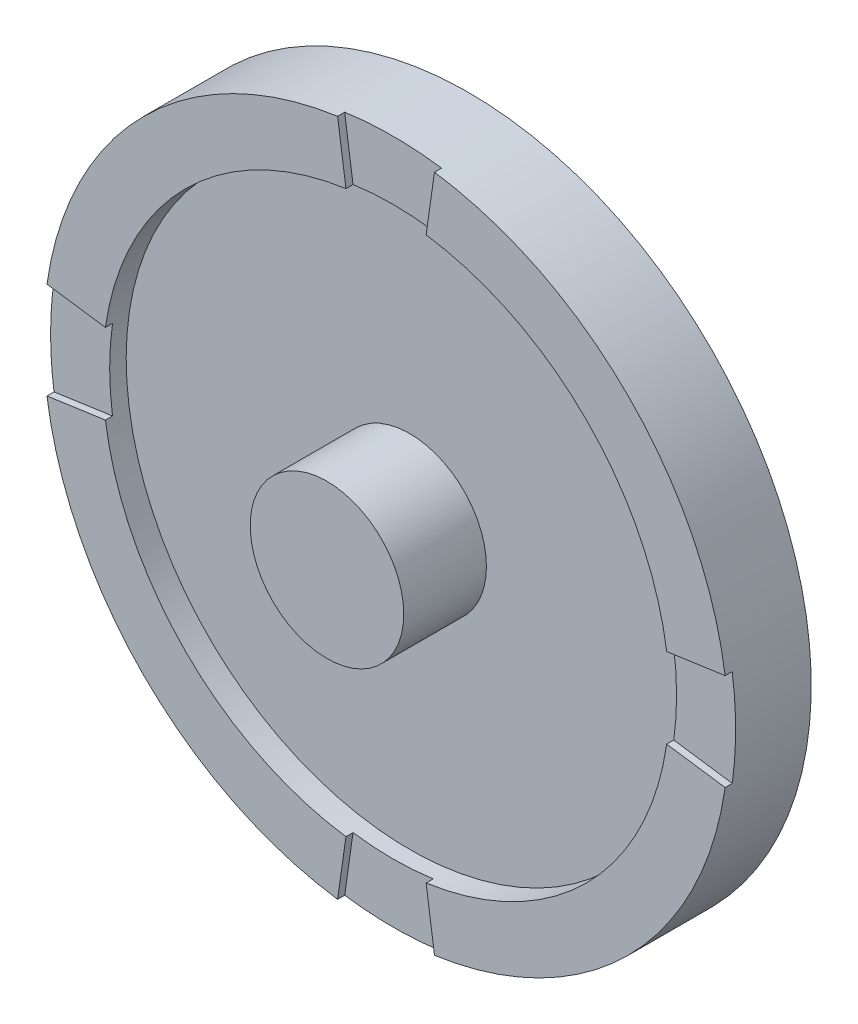
ISO-10303-21;
HEADER;
FILE_DESCRIPTION(('STEP AP214'),'2;1');
FILE_NAME('part.step','',(''),(''),'','','');
FILE_SCHEMA(('AUTOMOTIVE_DESIGN { 1 0 10303 214 1 1 1 1 }'));
ENDSEC;
DATA;
#1=APPLICATION_CONTEXT('core data for automotive mechanical design processes');
#2=APPLICATION_PROTOCOL_DEFINITION('international standard','automotive_design',2000,#1);
#3=PRODUCT_CONTEXT('',#1,'mechanical');
#4=PRODUCT('Part','Part','',(#3));
#5=PRODUCT_RELATED_PRODUCT_CATEGORY('part','',(#4));
#6=PRODUCT_DEFINITION_FORMATION('','',#4);
#7=PRODUCT_DEFINITION_CONTEXT('part definition',#1,'design');
#8=PRODUCT_DEFINITION('design','',#6,#7);
#9=PRODUCT_DEFINITION_SHAPE('','',#8);
#10=(LENGTH_UNIT() NAMED_UNIT(*) SI_UNIT(.MILLI.,.METRE.));
#11=(NAMED_UNIT(*) PLANE_ANGLE_UNIT() SI_UNIT($,.RADIAN.));
#12=(NAMED_UNIT(*) SI_UNIT($,.STERADIAN.) SOLID_ANGLE_UNIT());
#13=UNCERTAINTY_MEASURE_WITH_UNIT(LENGTH_MEASURE(1.E-05),#10,'distance_accuracy_value','');
#14=(GEOMETRIC_REPRESENTATION_CONTEXT(3) GLOBAL_UNCERTAINTY_ASSIGNED_CONTEXT((#13)) GLOBAL_UNIT_ASSIGNED_CONTEXT((#10,
#11,#12)) REPRESENTATION_CONTEXT('',''));
#15=CARTESIAN_POINT('',(0.,0.,0.));
#16=DIRECTION('',(0.,0.,1.));
#17=DIRECTION('',(1.,0.,0.));
#18=AXIS2_PLACEMENT_3D('',#15,#16,#17);
#19=CARTESIAN_POINT('',(0.,0.,7.));
#20=DIRECTION('',(0.,0.,-1.));
#21=DIRECTION('',(-1.,0.,0.));
#22=AXIS2_PLACEMENT_3D('',#19,#20,#21);
#23=PLANE('',#22);
#24=CARTESIAN_POINT('',(0.,0.,7.));
#25=DIRECTION('',(0.,0.,-1.));
#26=DIRECTION('',(-1.,0.,0.));
#27=AXIS2_PLACEMENT_3D('',#24,#25,#26);
#28=CIRCLE('',#27,24.);
#29=CARTESIAN_POINT('',(23.758787847868,-3.39411254969543,7.));
#30=VERTEX_POINT('',#29);
#31=CARTESIAN_POINT('',(3.39411254969543,-23.758787847868,7.));
#32=VERTEX_POINT('',#31);
#33=EDGE_CURVE('E247',#30,#32,#28,.T.);
#34=ORIENTED_EDGE('',*,*,#33,.T.);
#35=DIRECTION('',(-0.14142135623731,0.989949493661166,0.));
#36=VECTOR('',#35,1.);
#37=CARTESIAN_POINT('',(3.39411254969543,-23.758787847868,7.));
#38=LINE('',#37,#36);
#39=CARTESIAN_POINT('',(4.10121933088197,-28.7085353161738,7.));
#40=VERTEX_POINT('',#39);
#41=EDGE_CURVE('E159',#40,#32,#38,.T.);
#42=ORIENTED_EDGE('',*,*,#41,.F.);
#43=CARTESIAN_POINT('',(0.,0.,7.));
#44=DIRECTION('',(0.,0.,-1.));
#45=DIRECTION('',(-1.,0.,0.));
#46=AXIS2_PLACEMENT_3D('',#43,#44,#45);
#47=CIRCLE('',#46,29.);
#48=CARTESIAN_POINT('',(28.7085353161738,-4.10121933088198,7.));
#49=VERTEX_POINT('',#48);
#50=EDGE_CURVE('E251',#49,#40,#47,.T.);
#51=ORIENTED_EDGE('',*,*,#50,.F.);
#52=DIRECTION('',(0.989949493661167,-0.14142135623731,0.));
#53=VECTOR('',#52,1.);
#54=CARTESIAN_POINT('',(23.758787847868,-3.39411254969543,7.));
#55=LINE('',#54,#53);
#56=EDGE_CURVE('E213',#30,#49,#55,.T.);
#57=ORIENTED_EDGE('',*,*,#56,.F.);
#58=EDGE_LOOP('',(#34,#42,#51,#57));
#59=FACE_BOUND('',#58,.T.);
#60=ADVANCED_FACE('F31',(#59),#23,.F.);
#61=CARTESIAN_POINT('',(-4.10121933088197,-28.7085353161738,7.));
#62=VERTEX_POINT('',#61);
#63=CARTESIAN_POINT('',(-28.7085353161738,-4.10121933088196,7.));
#64=VERTEX_POINT('',#63);
#65=EDGE_CURVE('E255',#62,#64,#47,.T.);
#66=ORIENTED_EDGE('',*,*,#65,.F.);
#67=DIRECTION('',(-0.141421356237309,-0.989949493661166,0.));
#68=VECTOR('',#67,1.);
#69=CARTESIAN_POINT('',(-3.39411254969543,-23.758787847868,7.));
#70=LINE('',#69,#68);
#71=CARTESIAN_POINT('',(-3.39411254969543,-23.758787847868,7.));
#72=VERTEX_POINT('',#71);
#73=EDGE_CURVE('E314',#72,#62,#70,.T.);
#74=ORIENTED_EDGE('',*,*,#73,.F.);
#75=CARTESIAN_POINT('',(-23.758787847868,-3.39411254969543,7.));
#76=VERTEX_POINT('',#75);
#77=EDGE_CURVE('E164',#72,#76,#28,.T.);
#78=ORIENTED_EDGE('',*,*,#77,.T.);
#79=DIRECTION('',(0.989949493661167,0.14142135623731,0.));
#80=VECTOR('',#79,1.);
#81=CARTESIAN_POINT('',(-23.758787847868,-3.39411254969543,7.));
#82=LINE('',#81,#80);
#83=EDGE_CURVE('E174',#64,#76,#82,.T.);
#84=ORIENTED_EDGE('',*,*,#83,.F.);
#85=EDGE_LOOP('',(#66,#74,#78,#84));
#86=FACE_BOUND('',#85,.T.);
#87=ADVANCED_FACE('F277',(#86),#23,.F.);
#88=CARTESIAN_POINT('',(-28.7085353161738,4.10121933088197,7.));
#89=VERTEX_POINT('',#88);
#90=CARTESIAN_POINT('',(-4.10121933088198,28.7085353161738,7.));
#91=VERTEX_POINT('',#90);
#92=EDGE_CURVE('E303',#89,#91,#47,.T.);
#93=ORIENTED_EDGE('',*,*,#92,.F.);
#94=DIRECTION('',(-0.989949493661166,0.14142135623731,0.));
#95=VECTOR('',#94,1.);
#96=CARTESIAN_POINT('',(-23.758787847868,3.39411254969543,7.));
#97=LINE('',#96,#95);
#98=CARTESIAN_POINT('',(-23.758787847868,3.39411254969543,7.));
#99=VERTEX_POINT('',#98);
#100=EDGE_CURVE('E181',#99,#89,#97,.T.);
#101=ORIENTED_EDGE('',*,*,#100,.F.);
#102=CARTESIAN_POINT('',(-3.39411254969543,23.758787847868,7.));
#103=VERTEX_POINT('',#102);
#104=EDGE_CURVE('E315',#99,#103,#28,.T.);
#105=ORIENTED_EDGE('',*,*,#104,.T.);
#106=DIRECTION('',(0.141421356237309,-0.989949493661166,0.));
#107=VECTOR('',#106,1.);
#108=CARTESIAN_POINT('',(-3.39411254969543,23.758787847868,7.));
#109=LINE('',#108,#107);
#110=EDGE_CURVE('E199',#91,#103,#109,.T.);
#111=ORIENTED_EDGE('',*,*,#110,.F.);
#112=EDGE_LOOP('',(#93,#101,#105,#111));
#113=FACE_BOUND('',#112,.T.);
#114=ADVANCED_FACE('F269',(#113),#23,.F.);
#115=CARTESIAN_POINT('',(0.,0.,5.));
#116=DIRECTION('',(0.,0.,1.));
#117=DIRECTION('',(1.,0.,0.));
#118=AXIS2_PLACEMENT_3D('',#115,#116,#117);
#119=PLANE('',#118);
#120=CARTESIAN_POINT('',(0.,0.,5.));
#121=DIRECTION('',(0.,0.,1.));
#122=DIRECTION('',(1.,0.,0.));
#123=AXIS2_PLACEMENT_3D('',#120,#121,#122);
#124=CIRCLE('',#123,24.);
#125=CARTESIAN_POINT('',(24.,0.,5.));
#126=VERTEX_POINT('',#125);
#127=EDGE_CURVE('E254',#126,#126,#124,.T.);
#128=ORIENTED_EDGE('',*,*,#127,.T.);
#129=EDGE_LOOP('',(#128));
#130=FACE_BOUND('',#129,.T.);
#131=CARTESIAN_POINT('',(0.,0.,5.));
#132=DIRECTION('',(0.,0.,1.));
#133=DIRECTION('',(1.,0.,0.));
#134=AXIS2_PLACEMENT_3D('',#131,#132,#133);
#135=CIRCLE('',#134,6.5);
#136=CARTESIAN_POINT('',(6.5,0.,5.));
#137=VERTEX_POINT('',#136);
#138=EDGE_CURVE('E35',#137,#137,#135,.T.);
#139=ORIENTED_EDGE('',*,*,#138,.F.);
#140=EDGE_LOOP('',(#139));
#141=FACE_BOUND('',#140,.T.);
#142=ADVANCED_FACE('F267',(#130,#141),#119,.T.);
#143=CARTESIAN_POINT('',(0.,0.,12.));
#144=DIRECTION('',(0.,0.,-1.));
#145=DIRECTION('',(-1.,0.,0.));
#146=AXIS2_PLACEMENT_3D('',#143,#144,#145);
#147=CYLINDRICAL_SURFACE('',#146,6.5);
#148=CARTESIAN_POINT('',(0.,0.,12.));
#149=DIRECTION('',(0.,0.,1.));
#150=DIRECTION('',(1.,0.,0.));
#151=AXIS2_PLACEMENT_3D('',#148,#149,#150);
#152=CIRCLE('',#151,6.5);
#153=CARTESIAN_POINT('',(6.5,0.,12.));
#154=VERTEX_POINT('',#153);
#155=EDGE_CURVE('E11',#154,#154,#152,.T.);
#156=ORIENTED_EDGE('',*,*,#155,.F.);
#157=EDGE_LOOP('',(#156));
#158=FACE_BOUND('',#157,.T.);
#159=ORIENTED_EDGE('',*,*,#138,.T.);
#160=EDGE_LOOP('',(#159));
#161=FACE_BOUND('',#160,.T.);
#162=ADVANCED_FACE('F265',(#158,#161),#147,.T.);
#163=CARTESIAN_POINT('',(0.,0.,12.));
#164=DIRECTION('',(0.,0.,1.));
#165=DIRECTION('',(1.,0.,0.));
#166=AXIS2_PLACEMENT_3D('',#163,#164,#165);
#167=PLANE('',#166);
#168=ORIENTED_EDGE('',*,*,#155,.T.);
#169=EDGE_LOOP('',(#168));
#170=FACE_BOUND('',#169,.T.);
#171=ADVANCED_FACE('F274',(#170),#167,.T.);
#172=CARTESIAN_POINT('',(0.,0.,7.));
#173=DIRECTION('',(0.,0.,-1.));
#174=DIRECTION('',(-1.,0.,0.));
#175=AXIS2_PLACEMENT_3D('',#172,#173,#174);
#176=CYLINDRICAL_SURFACE('',#175,29.);
#177=DIRECTION('',(0.,0.,1.));
#178=VECTOR('',#177,1.);
#179=CARTESIAN_POINT('',(4.10121933088197,-28.7085353161738,6.4));
#180=LINE('',#179,#178);
#181=CARTESIAN_POINT('',(4.10121933088197,-28.7085353161738,6.4));
#182=VERTEX_POINT('',#181);
#183=EDGE_CURVE('E166',#182,#40,#180,.T.);
#184=ORIENTED_EDGE('',*,*,#183,.F.);
#185=CARTESIAN_POINT('',(0.,0.,6.4));
#186=DIRECTION('',(0.,0.,1.));
#187=DIRECTION('',(-1.,0.,0.));
#188=AXIS2_PLACEMENT_3D('',#185,#186,#187);
#189=CIRCLE('',#188,29.);
#190=CARTESIAN_POINT('',(-4.10121933088197,-28.7085353161738,6.4));
#191=VERTEX_POINT('',#190);
#192=EDGE_CURVE('E152',#191,#182,#189,.T.);
#193=ORIENTED_EDGE('',*,*,#192,.F.);
#194=DIRECTION('',(0.,0.,1.));
#195=VECTOR('',#194,1.);
#196=CARTESIAN_POINT('',(-4.10121933088197,-28.7085353161738,6.4));
#197=LINE('',#196,#195);
#198=EDGE_CURVE('E150',#191,#62,#197,.T.);
#199=ORIENTED_EDGE('',*,*,#198,.T.);
#200=ORIENTED_EDGE('',*,*,#65,.T.);
#201=DIRECTION('',(0.,0.,1.));
#202=VECTOR('',#201,1.);
#203=CARTESIAN_POINT('',(-28.7085353161738,-4.10121933088196,6.4));
#204=LINE('',#203,#202);
#205=CARTESIAN_POINT('',(-28.7085353161738,-4.10121933088196,6.4));
#206=VERTEX_POINT('',#205);
#207=EDGE_CURVE('E189',#206,#64,#204,.T.);
#208=ORIENTED_EDGE('',*,*,#207,.F.);
#209=CARTESIAN_POINT('',(0.,0.,6.4));
#210=DIRECTION('',(0.,0.,1.));
#211=DIRECTION('',(-1.,0.,0.));
#212=AXIS2_PLACEMENT_3D('',#209,#210,#211);
#213=CIRCLE('',#212,29.);
#214=CARTESIAN_POINT('',(-28.7085353161738,4.10121933088197,6.4));
#215=VERTEX_POINT('',#214);
#216=EDGE_CURVE('E177',#215,#206,#213,.T.);
#217=ORIENTED_EDGE('',*,*,#216,.F.);
#218=DIRECTION('',(0.,0.,1.));
#219=VECTOR('',#218,1.);
#220=CARTESIAN_POINT('',(-28.7085353161738,4.10121933088197,6.4));
#221=LINE('',#220,#219);
#222=EDGE_CURVE('E192',#215,#89,#221,.T.);
#223=ORIENTED_EDGE('',*,*,#222,.T.);
#224=ORIENTED_EDGE('',*,*,#92,.T.);
#225=DIRECTION('',(0.,0.,1.));
#226=VECTOR('',#225,1.);
#227=CARTESIAN_POINT('',(-4.10121933088198,28.7085353161738,6.4));
#228=LINE('',#227,#226);
#229=CARTESIAN_POINT('',(-4.10121933088198,28.7085353161738,6.4));
#230=VERTEX_POINT('',#229);
#231=EDGE_CURVE('E214',#230,#91,#228,.T.);
#232=ORIENTED_EDGE('',*,*,#231,.F.);
#233=CARTESIAN_POINT('',(0.,0.,6.4));
#234=DIRECTION('',(0.,0.,1.));
#235=DIRECTION('',(-1.,0.,0.));
#236=AXIS2_PLACEMENT_3D('',#233,#234,#235);
#237=CIRCLE('',#236,29.);
#238=CARTESIAN_POINT('',(4.10121933088197,28.7085353161738,6.4));
#239=VERTEX_POINT('',#238);
#240=EDGE_CURVE('E202',#239,#230,#237,.T.);
#241=ORIENTED_EDGE('',*,*,#240,.F.);
#242=DIRECTION('',(0.,0.,1.));
#243=VECTOR('',#242,1.);
#244=CARTESIAN_POINT('',(4.10121933088197,28.7085353161738,6.4));
#245=LINE('',#244,#243);
#246=CARTESIAN_POINT('',(4.10121933088197,28.7085353161738,7.));
#247=VERTEX_POINT('',#246);
#248=EDGE_CURVE('E217',#239,#247,#245,.T.);
#249=ORIENTED_EDGE('',*,*,#248,.T.);
#250=CARTESIAN_POINT('',(28.7085353161738,4.10121933088198,7.));
#251=VERTEX_POINT('',#250);
#252=EDGE_CURVE('E256',#247,#251,#47,.T.);
#253=ORIENTED_EDGE('',*,*,#252,.T.);
#254=DIRECTION('',(0.,0.,1.));
#255=VECTOR('',#254,1.);
#256=CARTESIAN_POINT('',(28.7085353161738,4.10121933088198,6.4));
#257=LINE('',#256,#255);
#258=CARTESIAN_POINT('',(28.7085353161738,4.10121933088198,6.4));
#259=VERTEX_POINT('',#258);
#260=EDGE_CURVE('E240',#259,#251,#257,.T.);
#261=ORIENTED_EDGE('',*,*,#260,.F.);
#262=CARTESIAN_POINT('',(0.,0.,6.4));
#263=DIRECTION('',(0.,0.,1.));
#264=DIRECTION('',(-1.,0.,0.));
#265=AXIS2_PLACEMENT_3D('',#262,#263,#264);
#266=CIRCLE('',#265,29.);
#267=CARTESIAN_POINT('',(28.7085353161738,-4.10121933088198,6.4));
#268=VERTEX_POINT('',#267);
#269=EDGE_CURVE('E228',#268,#259,#266,.T.);
#270=ORIENTED_EDGE('',*,*,#269,.F.);
#271=DIRECTION('',(0.,0.,1.));
#272=VECTOR('',#271,1.);
#273=CARTESIAN_POINT('',(28.7085353161738,-4.10121933088198,6.4));
#274=LINE('',#273,#272);
#275=EDGE_CURVE('E243',#268,#49,#274,.T.);
#276=ORIENTED_EDGE('',*,*,#275,.T.);
#277=ORIENTED_EDGE('',*,*,#50,.T.);
#278=EDGE_LOOP('',(#184,#193,#199,#200,#208,#217,#223,#224,#232,#241,#249,#253,#261,#270,#276,#277));
#279=FACE_BOUND('',#278,.T.);
#280=CARTESIAN_POINT('',(0.,0.,0.));
#281=DIRECTION('',(0.,0.,-1.));
#282=DIRECTION('',(-1.,0.,0.));
#283=AXIS2_PLACEMENT_3D('',#280,#281,#282);
#284=CIRCLE('',#283,29.);
#285=CARTESIAN_POINT('',(-29.,0.,0.));
#286=VERTEX_POINT('',#285);
#287=EDGE_CURVE('E250',#286,#286,#284,.T.);
#288=ORIENTED_EDGE('',*,*,#287,.F.);
#289=EDGE_LOOP('',(#288));
#290=FACE_BOUND('',#289,.T.);
#291=ADVANCED_FACE('F290',(#279,#290),#176,.T.);
#292=ORIENTED_EDGE('',*,*,#252,.F.);
#293=DIRECTION('',(0.141421356237309,0.989949493661167,0.));
#294=VECTOR('',#293,1.);
#295=CARTESIAN_POINT('',(3.39411254969543,23.758787847868,7.));
#296=LINE('',#295,#294);
#297=CARTESIAN_POINT('',(3.39411254969543,23.758787847868,7.));
#298=VERTEX_POINT('',#297);
#299=EDGE_CURVE('E188',#298,#247,#296,.T.);
#300=ORIENTED_EDGE('',*,*,#299,.F.);
#301=CARTESIAN_POINT('',(23.758787847868,3.39411254969543,7.));
#302=VERTEX_POINT('',#301);
#303=EDGE_CURVE('E239',#298,#302,#28,.T.);
#304=ORIENTED_EDGE('',*,*,#303,.T.);
#305=DIRECTION('',(-0.989949493661167,-0.141421356237309,0.));
#306=VECTOR('',#305,1.);
#307=CARTESIAN_POINT('',(23.758787847868,3.39411254969543,7.));
#308=LINE('',#307,#306);
#309=EDGE_CURVE('E225',#251,#302,#308,.T.);
#310=ORIENTED_EDGE('',*,*,#309,.F.);
#311=EDGE_LOOP('',(#292,#300,#304,#310));
#312=FACE_BOUND('',#311,.T.);
#313=ADVANCED_FACE('F280',(#312),#23,.F.);
#314=CARTESIAN_POINT('',(0.,0.,7.));
#315=DIRECTION('',(0.,0.,-1.));
#316=DIRECTION('',(-1.,0.,0.));
#317=AXIS2_PLACEMENT_3D('',#314,#315,#316);
#318=CYLINDRICAL_SURFACE('',#317,24.);
#319=ORIENTED_EDGE('',*,*,#127,.F.);
#320=EDGE_LOOP('',(#319));
#321=FACE_BOUND('',#320,.T.);
#322=CARTESIAN_POINT('',(0.,0.,6.4));
#323=DIRECTION('',(0.,0.,-1.));
#324=DIRECTION('',(-1.,0.,0.));
#325=AXIS2_PLACEMENT_3D('',#322,#323,#324);
#326=CIRCLE('',#325,24.);
#327=CARTESIAN_POINT('',(3.39411254969543,-23.758787847868,6.4));
#328=VERTEX_POINT('',#327);
#329=CARTESIAN_POINT('',(-3.39411254969543,-23.758787847868,6.4));
#330=VERTEX_POINT('',#329);
#331=EDGE_CURVE('E153',#328,#330,#326,.T.);
#332=ORIENTED_EDGE('',*,*,#331,.F.);
#333=DIRECTION('',(0.,0.,1.));
#334=VECTOR('',#333,1.);
#335=CARTESIAN_POINT('',(3.39411254969543,-23.758787847868,6.4));
#336=LINE('',#335,#334);
#337=EDGE_CURVE('E183',#328,#32,#336,.T.);
#338=ORIENTED_EDGE('',*,*,#337,.T.);
#339=ORIENTED_EDGE('',*,*,#33,.F.);
#340=DIRECTION('',(0.,0.,1.));
#341=VECTOR('',#340,1.);
#342=CARTESIAN_POINT('',(23.758787847868,-3.39411254969543,6.4));
#343=LINE('',#342,#341);
#344=CARTESIAN_POINT('',(23.758787847868,-3.39411254969543,6.4));
#345=VERTEX_POINT('',#344);
#346=EDGE_CURVE('E232',#345,#30,#343,.T.);
#347=ORIENTED_EDGE('',*,*,#346,.F.);
#348=CARTESIAN_POINT('',(0.,0.,6.4));
#349=DIRECTION('',(0.,0.,-1.));
#350=DIRECTION('',(-1.,0.,0.));
#351=AXIS2_PLACEMENT_3D('',#348,#349,#350);
#352=CIRCLE('',#351,24.);
#353=CARTESIAN_POINT('',(23.758787847868,3.39411254969543,6.4));
#354=VERTEX_POINT('',#353);
#355=EDGE_CURVE('E221',#354,#345,#352,.T.);
#356=ORIENTED_EDGE('',*,*,#355,.F.);
#357=DIRECTION('',(0.,0.,1.));
#358=VECTOR('',#357,1.);
#359=CARTESIAN_POINT('',(23.758787847868,3.39411254969543,6.4));
#360=LINE('',#359,#358);
#361=EDGE_CURVE('E236',#354,#302,#360,.T.);
#362=ORIENTED_EDGE('',*,*,#361,.T.);
#363=ORIENTED_EDGE('',*,*,#303,.F.);
#364=DIRECTION('',(0.,0.,1.));
#365=VECTOR('',#364,1.);
#366=CARTESIAN_POINT('',(3.39411254969543,23.758787847868,6.4));
#367=LINE('',#366,#365);
#368=CARTESIAN_POINT('',(3.39411254969543,23.758787847868,6.4));
#369=VERTEX_POINT('',#368);
#370=EDGE_CURVE('E206',#369,#298,#367,.T.);
#371=ORIENTED_EDGE('',*,*,#370,.F.);
#372=CARTESIAN_POINT('',(0.,0.,6.4));
#373=DIRECTION('',(0.,0.,-1.));
#374=DIRECTION('',(1.,0.,0.));
#375=AXIS2_PLACEMENT_3D('',#372,#373,#374);
#376=CIRCLE('',#375,24.);
#377=CARTESIAN_POINT('',(-3.39411254969543,23.758787847868,6.4));
#378=VERTEX_POINT('',#377);
#379=EDGE_CURVE('E196',#378,#369,#376,.T.);
#380=ORIENTED_EDGE('',*,*,#379,.F.);
#381=DIRECTION('',(0.,0.,1.));
#382=VECTOR('',#381,1.);
#383=CARTESIAN_POINT('',(-3.39411254969543,23.758787847868,6.4));
#384=LINE('',#383,#382);
#385=EDGE_CURVE('E210',#378,#103,#384,.T.);
#386=ORIENTED_EDGE('',*,*,#385,.T.);
#387=ORIENTED_EDGE('',*,*,#104,.F.);
#388=DIRECTION('',(0.,0.,1.));
#389=VECTOR('',#388,1.);
#390=CARTESIAN_POINT('',(-23.758787847868,3.39411254969543,6.4));
#391=LINE('',#390,#389);
#392=CARTESIAN_POINT('',(-23.758787847868,3.39411254969543,6.4));
#393=VERTEX_POINT('',#392);
#394=EDGE_CURVE('E180',#393,#99,#391,.T.);
#395=ORIENTED_EDGE('',*,*,#394,.F.);
#396=CARTESIAN_POINT('',(0.,0.,6.4));
#397=DIRECTION('',(0.,0.,-1.));
#398=DIRECTION('',(1.,0.,0.));
#399=AXIS2_PLACEMENT_3D('',#396,#397,#398);
#400=CIRCLE('',#399,24.);
#401=CARTESIAN_POINT('',(-23.758787847868,-3.39411254969543,6.4));
#402=VERTEX_POINT('',#401);
#403=EDGE_CURVE('E171',#402,#393,#400,.T.);
#404=ORIENTED_EDGE('',*,*,#403,.F.);
#405=DIRECTION('',(0.,0.,1.));
#406=VECTOR('',#405,1.);
#407=CARTESIAN_POINT('',(-23.758787847868,-3.39411254969543,6.4));
#408=LINE('',#407,#406);
#409=EDGE_CURVE('E186',#402,#76,#408,.T.);
#410=ORIENTED_EDGE('',*,*,#409,.T.);
#411=ORIENTED_EDGE('',*,*,#77,.F.);
#412=DIRECTION('',(0.,0.,1.));
#413=VECTOR('',#412,1.);
#414=CARTESIAN_POINT('',(-3.39411254969543,-23.758787847868,6.4));
#415=LINE('',#414,#413);
#416=EDGE_CURVE('E147',#330,#72,#415,.T.);
#417=ORIENTED_EDGE('',*,*,#416,.F.);
#418=EDGE_LOOP('',(#332,#338,#339,#347,#356,#362,#363,#371,#380,#386,#387,#395,#404,#410,#411,#417));
#419=FACE_BOUND('',#418,.T.);
#420=ADVANCED_FACE('F162',(#321,#419),#318,.F.);
#421=CARTESIAN_POINT('',(0.,0.,0.));
#422=DIRECTION('',(0.,0.,1.));
#423=DIRECTION('',(1.,0.,0.));
#424=AXIS2_PLACEMENT_3D('',#421,#422,#423);
#425=PLANE('',#424);
#426=ORIENTED_EDGE('',*,*,#287,.T.);
#427=EDGE_LOOP('',(#426));
#428=FACE_BOUND('',#427,.T.);
#429=ADVANCED_FACE('F33',(#428),#425,.F.);
#430=CARTESIAN_POINT('',(23.758787847868,3.39411254969543,6.4));
#431=DIRECTION('',(-0.141421356237309,0.989949493661166,0.));
#432=DIRECTION('',(-0.989949493661167,-0.14142135623731,0.));
#433=AXIS2_PLACEMENT_3D('',#430,#431,#432);
#434=PLANE('',#433);
#435=ORIENTED_EDGE('',*,*,#309,.T.);
#436=ORIENTED_EDGE('',*,*,#361,.F.);
#437=DIRECTION('',(-0.989949493661167,-0.141421356237309,0.));
#438=VECTOR('',#437,1.);
#439=CARTESIAN_POINT('',(23.758787847868,3.39411254969543,6.4));
#440=LINE('',#439,#438);
#441=EDGE_CURVE('E230',#259,#354,#440,.T.);
#442=ORIENTED_EDGE('',*,*,#441,.F.);
#443=ORIENTED_EDGE('',*,*,#260,.T.);
#444=EDGE_LOOP('',(#435,#436,#442,#443));
#445=FACE_BOUND('',#444,.T.);
#446=ADVANCED_FACE('F322',(#445),#434,.F.);
#447=CARTESIAN_POINT('',(23.758787847868,-3.39411254969543,6.4));
#448=DIRECTION('',(-0.14142135623731,-0.989949493661167,0.));
#449=DIRECTION('',(0.989949493661167,-0.14142135623731,0.));
#450=AXIS2_PLACEMENT_3D('',#447,#448,#449);
#451=PLANE('',#450);
#452=ORIENTED_EDGE('',*,*,#56,.T.);
#453=ORIENTED_EDGE('',*,*,#275,.F.);
#454=DIRECTION('',(0.989949493661167,-0.14142135623731,0.));
#455=VECTOR('',#454,1.);
#456=CARTESIAN_POINT('',(23.758787847868,-3.39411254969543,6.4));
#457=LINE('',#456,#455);
#458=EDGE_CURVE('E224',#345,#268,#457,.T.);
#459=ORIENTED_EDGE('',*,*,#458,.F.);
#460=ORIENTED_EDGE('',*,*,#346,.T.);
#461=EDGE_LOOP('',(#452,#453,#459,#460));
#462=FACE_BOUND('',#461,.T.);
#463=ADVANCED_FACE('F371',(#462),#451,.F.);
#464=CARTESIAN_POINT('',(0.,0.,6.4));
#465=DIRECTION('',(0.,0.,-1.));
#466=DIRECTION('',(-1.,0.,0.));
#467=AXIS2_PLACEMENT_3D('',#464,#465,#466);
#468=PLANE('',#467);
#469=ORIENTED_EDGE('',*,*,#355,.T.);
#470=ORIENTED_EDGE('',*,*,#458,.T.);
#471=ORIENTED_EDGE('',*,*,#269,.T.);
#472=ORIENTED_EDGE('',*,*,#441,.T.);
#473=EDGE_LOOP('',(#469,#470,#471,#472));
#474=FACE_BOUND('',#473,.T.);
#475=ADVANCED_FACE('F328',(#474),#468,.F.);
#476=CARTESIAN_POINT('',(-3.39411254969543,23.758787847868,6.4));
#477=DIRECTION('',(-0.989949493661166,-0.141421356237309,0.));
#478=DIRECTION('',(0.141421356237309,-0.989949493661167,0.));
#479=AXIS2_PLACEMENT_3D('',#476,#477,#478);
#480=PLANE('',#479);
#481=ORIENTED_EDGE('',*,*,#110,.T.);
#482=ORIENTED_EDGE('',*,*,#385,.F.);
#483=DIRECTION('',(0.141421356237309,-0.989949493661166,0.));
#484=VECTOR('',#483,1.);
#485=CARTESIAN_POINT('',(-3.39411254969543,23.758787847868,6.4));
#486=LINE('',#485,#484);
#487=EDGE_CURVE('E204',#230,#378,#486,.T.);
#488=ORIENTED_EDGE('',*,*,#487,.F.);
#489=ORIENTED_EDGE('',*,*,#231,.T.);
#490=EDGE_LOOP('',(#481,#482,#488,#489));
#491=FACE_BOUND('',#490,.T.);
#492=ADVANCED_FACE('F362',(#491),#480,.F.);
#493=CARTESIAN_POINT('',(3.39411254969543,23.758787847868,6.4));
#494=DIRECTION('',(0.989949493661166,-0.141421356237309,0.));
#495=DIRECTION('',(0.14142135623731,0.989949493661167,0.));
#496=AXIS2_PLACEMENT_3D('',#493,#494,#495);
#497=PLANE('',#496);
#498=ORIENTED_EDGE('',*,*,#299,.T.);
#499=ORIENTED_EDGE('',*,*,#248,.F.);
#500=DIRECTION('',(0.141421356237309,0.989949493661167,0.));
#501=VECTOR('',#500,1.);
#502=CARTESIAN_POINT('',(3.39411254969543,23.758787847868,6.4));
#503=LINE('',#502,#501);
#504=EDGE_CURVE('E198',#369,#239,#503,.T.);
#505=ORIENTED_EDGE('',*,*,#504,.F.);
#506=ORIENTED_EDGE('',*,*,#370,.T.);
#507=EDGE_LOOP('',(#498,#499,#505,#506));
#508=FACE_BOUND('',#507,.T.);
#509=ADVANCED_FACE('F360',(#508),#497,.F.);
#510=CARTESIAN_POINT('',(0.,0.,6.4));
#511=DIRECTION('',(0.,0.,1.));
#512=DIRECTION('',(1.,0.,0.));
#513=AXIS2_PLACEMENT_3D('',#510,#511,#512);
#514=PLANE('',#513);
#515=ORIENTED_EDGE('',*,*,#379,.T.);
#516=ORIENTED_EDGE('',*,*,#504,.T.);
#517=ORIENTED_EDGE('',*,*,#240,.T.);
#518=ORIENTED_EDGE('',*,*,#487,.T.);
#519=EDGE_LOOP('',(#515,#516,#517,#518));
#520=FACE_BOUND('',#519,.T.);
#521=ADVANCED_FACE('F354',(#520),#514,.T.);
#522=CARTESIAN_POINT('',(-23.758787847868,-3.39411254969543,6.4));
#523=DIRECTION('',(0.14142135623731,-0.989949493661166,0.));
#524=DIRECTION('',(0.989949493661167,0.14142135623731,0.));
#525=AXIS2_PLACEMENT_3D('',#522,#523,#524);
#526=PLANE('',#525);
#527=ORIENTED_EDGE('',*,*,#83,.T.);
#528=ORIENTED_EDGE('',*,*,#409,.F.);
#529=DIRECTION('',(0.989949493661167,0.14142135623731,0.));
#530=VECTOR('',#529,1.);
#531=CARTESIAN_POINT('',(-23.758787847868,-3.39411254969543,6.4));
#532=LINE('',#531,#530);
#533=EDGE_CURVE('E54',#206,#402,#532,.T.);
#534=ORIENTED_EDGE('',*,*,#533,.F.);
#535=ORIENTED_EDGE('',*,*,#207,.T.);
#536=EDGE_LOOP('',(#527,#528,#534,#535));
#537=FACE_BOUND('',#536,.T.);
#538=ADVANCED_FACE('F313',(#537),#526,.F.);
#539=CARTESIAN_POINT('',(-23.758787847868,3.39411254969543,6.4));
#540=DIRECTION('',(0.14142135623731,0.989949493661166,0.));
#541=DIRECTION('',(-0.989949493661167,0.14142135623731,0.));
#542=AXIS2_PLACEMENT_3D('',#539,#540,#541);
#543=PLANE('',#542);
#544=ORIENTED_EDGE('',*,*,#100,.T.);
#545=ORIENTED_EDGE('',*,*,#222,.F.);
#546=DIRECTION('',(-0.989949493661166,0.14142135623731,0.));
#547=VECTOR('',#546,1.);
#548=CARTESIAN_POINT('',(-23.758787847868,3.39411254969543,6.4));
#549=LINE('',#548,#547);
#550=EDGE_CURVE('E173',#393,#215,#549,.T.);
#551=ORIENTED_EDGE('',*,*,#550,.F.);
#552=ORIENTED_EDGE('',*,*,#394,.T.);
#553=EDGE_LOOP('',(#544,#545,#551,#552));
#554=FACE_BOUND('',#553,.T.);
#555=ADVANCED_FACE('F348',(#554),#543,.F.);
#556=CARTESIAN_POINT('',(0.,0.,6.4));
#557=DIRECTION('',(0.,0.,1.));
#558=DIRECTION('',(1.,0.,0.));
#559=AXIS2_PLACEMENT_3D('',#556,#557,#558);
#560=PLANE('',#559);
#561=ORIENTED_EDGE('',*,*,#403,.T.);
#562=ORIENTED_EDGE('',*,*,#550,.T.);
#563=ORIENTED_EDGE('',*,*,#216,.T.);
#564=ORIENTED_EDGE('',*,*,#533,.T.);
#565=EDGE_LOOP('',(#561,#562,#563,#564));
#566=FACE_BOUND('',#565,.T.);
#567=ADVANCED_FACE('F341',(#566),#560,.T.);
#568=CARTESIAN_POINT('',(3.39411254969543,-23.758787847868,6.4));
#569=DIRECTION('',(0.989949493661166,0.14142135623731,0.));
#570=DIRECTION('',(-0.14142135623731,0.989949493661167,0.));
#571=AXIS2_PLACEMENT_3D('',#568,#569,#570);
#572=PLANE('',#571);
#573=ORIENTED_EDGE('',*,*,#41,.T.);
#574=ORIENTED_EDGE('',*,*,#337,.F.);
#575=DIRECTION('',(-0.14142135623731,0.989949493661166,0.));
#576=VECTOR('',#575,1.);
#577=CARTESIAN_POINT('',(3.39411254969543,-23.758787847868,6.4));
#578=LINE('',#577,#576);
#579=EDGE_CURVE('E46',#182,#328,#578,.T.);
#580=ORIENTED_EDGE('',*,*,#579,.F.);
#581=ORIENTED_EDGE('',*,*,#183,.T.);
#582=EDGE_LOOP('',(#573,#574,#580,#581));
#583=FACE_BOUND('',#582,.T.);
#584=ADVANCED_FACE('F338',(#583),#572,.F.);
#585=CARTESIAN_POINT('',(-3.39411254969543,-23.758787847868,6.4));
#586=DIRECTION('',(-0.989949493661166,0.141421356237309,0.));
#587=DIRECTION('',(-0.141421356237309,-0.989949493661167,0.));
#588=AXIS2_PLACEMENT_3D('',#585,#586,#587);
#589=PLANE('',#588);
#590=ORIENTED_EDGE('',*,*,#73,.T.);
#591=ORIENTED_EDGE('',*,*,#198,.F.);
#592=DIRECTION('',(-0.141421356237309,-0.989949493661166,0.));
#593=VECTOR('',#592,1.);
#594=CARTESIAN_POINT('',(-3.39411254969543,-23.758787847868,6.4));
#595=LINE('',#594,#593);
#596=EDGE_CURVE('E144',#330,#191,#595,.T.);
#597=ORIENTED_EDGE('',*,*,#596,.F.);
#598=ORIENTED_EDGE('',*,*,#416,.T.);
#599=EDGE_LOOP('',(#590,#591,#597,#598));
#600=FACE_BOUND('',#599,.T.);
#601=ADVANCED_FACE('F145',(#600),#589,.F.);
#602=CARTESIAN_POINT('',(0.,0.,6.4));
#603=DIRECTION('',(0.,0.,-1.));
#604=DIRECTION('',(-1.,0.,0.));
#605=AXIS2_PLACEMENT_3D('',#602,#603,#604);
#606=PLANE('',#605);
#607=ORIENTED_EDGE('',*,*,#331,.T.);
#608=ORIENTED_EDGE('',*,*,#596,.T.);
#609=ORIENTED_EDGE('',*,*,#192,.T.);
#610=ORIENTED_EDGE('',*,*,#579,.T.);
#611=EDGE_LOOP('',(#607,#608,#609,#610));
#612=FACE_BOUND('',#611,.T.);
#613=ADVANCED_FACE('F156',(#612),#606,.F.);
#614=CLOSED_SHELL('',(#60,#87,#114,#142,#162,#171,#291,#313,#420,#429,#446,#463,#475,#492,#509,
#521,#538,#555,#567,#584,#601,#613));
#615=MANIFOLD_SOLID_BREP('B2',#614);
#616=ADVANCED_BREP_SHAPE_REPRESENTATION('',(#18,#615),#14);
#617=SHAPE_DEFINITION_REPRESENTATION(#9,#616);
ENDSEC;
END-ISO-10303-21;
